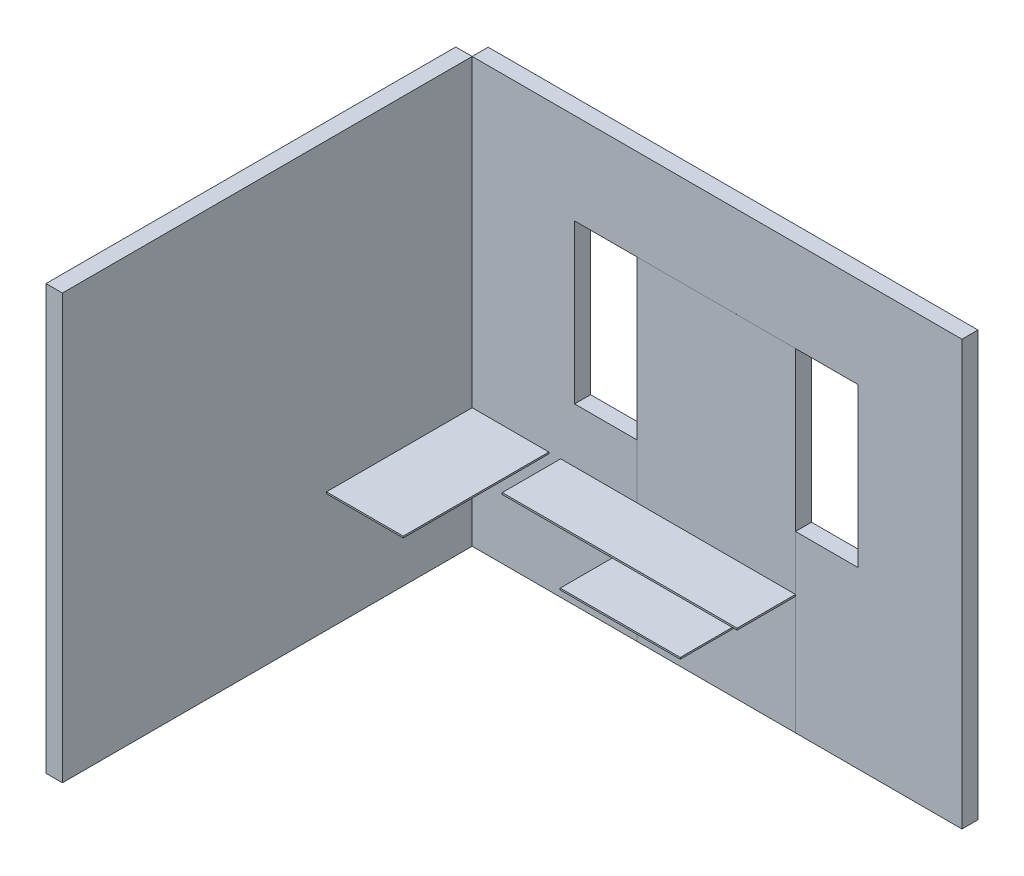
ISO-10303-21;
HEADER;
FILE_DESCRIPTION(('STEP AP214'),'2;1');
FILE_NAME('part.step','',(''),(''),'','','');
FILE_SCHEMA(('AUTOMOTIVE_DESIGN { 1 0 10303 214 1 1 1 1 }'));
ENDSEC;
DATA;
#1=APPLICATION_CONTEXT('core data for automotive mechanical design processes');
#2=APPLICATION_PROTOCOL_DEFINITION('international standard','automotive_design',2000,#1);
#3=PRODUCT_CONTEXT('',#1,'mechanical');
#4=PRODUCT('Part','Part','',(#3));
#5=PRODUCT_RELATED_PRODUCT_CATEGORY('part','',(#4));
#6=PRODUCT_DEFINITION_FORMATION('','',#4);
#7=PRODUCT_DEFINITION_CONTEXT('part definition',#1,'design');
#8=PRODUCT_DEFINITION('design','',#6,#7);
#9=PRODUCT_DEFINITION_SHAPE('','',#8);
#10=(LENGTH_UNIT() NAMED_UNIT(*) SI_UNIT(.MILLI.,.METRE.));
#11=(NAMED_UNIT(*) PLANE_ANGLE_UNIT() SI_UNIT($,.RADIAN.));
#12=(NAMED_UNIT(*) SI_UNIT($,.STERADIAN.) SOLID_ANGLE_UNIT());
#13=UNCERTAINTY_MEASURE_WITH_UNIT(LENGTH_MEASURE(1.E-05),#10,'distance_accuracy_value','');
#14=(GEOMETRIC_REPRESENTATION_CONTEXT(3) GLOBAL_UNCERTAINTY_ASSIGNED_CONTEXT((#13)) GLOBAL_UNIT_ASSIGNED_CONTEXT((#10,
#11,#12)) REPRESENTATION_CONTEXT('',''));
#15=CARTESIAN_POINT('',(0.,0.,0.));
#16=DIRECTION('',(0.,0.,1.));
#17=DIRECTION('',(1.,0.,0.));
#18=AXIS2_PLACEMENT_3D('',#15,#16,#17);
#19=CARTESIAN_POINT('',(0.,749.389851407304,1010.));
#20=DIRECTION('',(1.,0.,0.));
#21=DIRECTION('',(0.,0.,-1.));
#22=AXIS2_PLACEMENT_3D('',#19,#20,#21);
#23=PLANE('',#22);
#24=DIRECTION('',(0.,-1.,0.));
#25=VECTOR('',#24,1.);
#26=CARTESIAN_POINT('',(0.,749.389851407304,100.));
#27=LINE('',#26,#25);
#28=CARTESIAN_POINT('',(0.,749.389851407304,100.));
#29=VERTEX_POINT('',#28);
#30=CARTESIAN_POINT('',(0.,739.389851407304,100.));
#31=VERTEX_POINT('',#30);
#32=EDGE_CURVE('E109',#29,#31,#27,.T.);
#33=ORIENTED_EDGE('',*,*,#32,.T.);
#34=DIRECTION('',(0.,0.,-1.));
#35=VECTOR('',#34,1.);
#36=CARTESIAN_POINT('',(0.,739.389851407304,1010.));
#37=LINE('',#36,#35);
#38=CARTESIAN_POINT('',(0.,739.389851407304,1010.));
#39=VERTEX_POINT('',#38);
#40=EDGE_CURVE('E12',#39,#31,#37,.T.);
#41=ORIENTED_EDGE('',*,*,#40,.F.);
#42=DIRECTION('',(0.,-1.,0.));
#43=VECTOR('',#42,1.);
#44=CARTESIAN_POINT('',(0.,749.389851407304,1010.));
#45=LINE('',#44,#43);
#46=CARTESIAN_POINT('',(0.,749.389851407304,1010.));
#47=VERTEX_POINT('',#46);
#48=EDGE_CURVE('E97',#47,#39,#45,.T.);
#49=ORIENTED_EDGE('',*,*,#48,.F.);
#50=DIRECTION('',(0.,0.,-1.));
#51=VECTOR('',#50,1.);
#52=CARTESIAN_POINT('',(0.,749.389851407304,1010.));
#53=LINE('',#52,#51);
#54=EDGE_CURVE('E105',#47,#29,#53,.T.);
#55=ORIENTED_EDGE('',*,*,#54,.T.);
#56=EDGE_LOOP('',(#33,#41,#49,#55));
#57=FACE_BOUND('',#56,.T.);
#58=ADVANCED_FACE('F46',(#57),#23,.F.);
#59=CARTESIAN_POINT('',(0.,739.389851407304,1010.));
#60=DIRECTION('',(0.,1.,0.));
#61=DIRECTION('',(0.,0.,1.));
#62=AXIS2_PLACEMENT_3D('',#59,#60,#61);
#63=PLANE('',#62);
#64=DIRECTION('',(1.,0.,0.));
#65=VECTOR('',#64,1.);
#66=CARTESIAN_POINT('',(0.,739.389851407304,100.));
#67=LINE('',#66,#65);
#68=CARTESIAN_POINT('',(479.151961804044,739.389851407304,100.));
#69=VERTEX_POINT('',#68);
#70=EDGE_CURVE('E101',#31,#69,#67,.T.);
#71=ORIENTED_EDGE('',*,*,#70,.T.);
#72=DIRECTION('',(0.,0.,-1.));
#73=VECTOR('',#72,1.);
#74=CARTESIAN_POINT('',(479.151961804044,739.389851407304,1010.));
#75=LINE('',#74,#73);
#76=CARTESIAN_POINT('',(479.151961804044,739.389851407304,1010.));
#77=VERTEX_POINT('',#76);
#78=EDGE_CURVE('E54',#77,#69,#75,.T.);
#79=ORIENTED_EDGE('',*,*,#78,.F.);
#80=DIRECTION('',(1.,0.,0.));
#81=VECTOR('',#80,1.);
#82=CARTESIAN_POINT('',(0.,739.389851407304,1010.));
#83=LINE('',#82,#81);
#84=EDGE_CURVE('E92',#39,#77,#83,.T.);
#85=ORIENTED_EDGE('',*,*,#84,.F.);
#86=ORIENTED_EDGE('',*,*,#40,.T.);
#87=EDGE_LOOP('',(#71,#79,#85,#86));
#88=FACE_BOUND('',#87,.T.);
#89=ADVANCED_FACE('F100',(#88),#63,.F.);
#90=CARTESIAN_POINT('',(479.151961804044,739.389851407304,1010.));
#91=DIRECTION('',(-1.,0.,0.));
#92=DIRECTION('',(0.,0.,1.));
#93=AXIS2_PLACEMENT_3D('',#90,#91,#92);
#94=PLANE('',#93);
#95=DIRECTION('',(0.,1.,0.));
#96=VECTOR('',#95,1.);
#97=CARTESIAN_POINT('',(479.151961804044,739.389851407304,100.));
#98=LINE('',#97,#96);
#99=CARTESIAN_POINT('',(479.151961804044,749.389851407304,100.));
#100=VERTEX_POINT('',#99);
#101=EDGE_CURVE('E79',#69,#100,#98,.T.);
#102=ORIENTED_EDGE('',*,*,#101,.T.);
#103=DIRECTION('',(0.,0.,-1.));
#104=VECTOR('',#103,1.);
#105=CARTESIAN_POINT('',(479.151961804044,749.389851407304,1010.));
#106=LINE('',#105,#104);
#107=CARTESIAN_POINT('',(479.151961804044,749.389851407304,1010.));
#108=VERTEX_POINT('',#107);
#109=EDGE_CURVE('E102',#108,#100,#106,.T.);
#110=ORIENTED_EDGE('',*,*,#109,.F.);
#111=DIRECTION('',(0.,1.,0.));
#112=VECTOR('',#111,1.);
#113=CARTESIAN_POINT('',(479.151961804044,739.389851407304,1010.));
#114=LINE('',#113,#112);
#115=EDGE_CURVE('E95',#77,#108,#114,.T.);
#116=ORIENTED_EDGE('',*,*,#115,.F.);
#117=ORIENTED_EDGE('',*,*,#78,.T.);
#118=EDGE_LOOP('',(#102,#110,#116,#117));
#119=FACE_BOUND('',#118,.T.);
#120=ADVANCED_FACE('F103',(#119),#94,.F.);
#121=CARTESIAN_POINT('',(479.151961804044,749.389851407304,1010.));
#122=DIRECTION('',(0.,-1.,0.));
#123=DIRECTION('',(0.,0.,-1.));
#124=AXIS2_PLACEMENT_3D('',#121,#122,#123);
#125=PLANE('',#124);
#126=DIRECTION('',(-1.,0.,0.));
#127=VECTOR('',#126,1.);
#128=CARTESIAN_POINT('',(479.151961804044,749.389851407304,100.));
#129=LINE('',#128,#127);
#130=EDGE_CURVE('E85',#100,#29,#129,.T.);
#131=ORIENTED_EDGE('',*,*,#130,.T.);
#132=ORIENTED_EDGE('',*,*,#54,.F.);
#133=DIRECTION('',(-1.,0.,0.));
#134=VECTOR('',#133,1.);
#135=CARTESIAN_POINT('',(479.151961804044,749.389851407304,1010.));
#136=LINE('',#135,#134);
#137=EDGE_CURVE('E62',#108,#47,#136,.T.);
#138=ORIENTED_EDGE('',*,*,#137,.F.);
#139=ORIENTED_EDGE('',*,*,#109,.T.);
#140=EDGE_LOOP('',(#131,#132,#138,#139));
#141=FACE_BOUND('',#140,.T.);
#142=ADVANCED_FACE('F116',(#141),#125,.F.);
#143=CARTESIAN_POINT('',(0.,0.,1010.));
#144=DIRECTION('',(0.,0.,1.));
#145=DIRECTION('',(1.,0.,0.));
#146=AXIS2_PLACEMENT_3D('',#143,#144,#145);
#147=PLANE('',#146);
#148=ORIENTED_EDGE('',*,*,#48,.T.);
#149=ORIENTED_EDGE('',*,*,#84,.T.);
#150=ORIENTED_EDGE('',*,*,#115,.T.);
#151=ORIENTED_EDGE('',*,*,#137,.T.);
#152=EDGE_LOOP('',(#148,#149,#150,#151));
#153=FACE_BOUND('',#152,.T.);
#154=ADVANCED_FACE('F93',(#153),#147,.T.);
#155=CARTESIAN_POINT('',(0.,0.,100.));
#156=DIRECTION('',(0.,0.,1.));
#157=DIRECTION('',(1.,0.,0.));
#158=AXIS2_PLACEMENT_3D('',#155,#156,#157);
#159=PLANE('',#158);
#160=ORIENTED_EDGE('',*,*,#32,.F.);
#161=ORIENTED_EDGE('',*,*,#130,.F.);
#162=ORIENTED_EDGE('',*,*,#101,.F.);
#163=ORIENTED_EDGE('',*,*,#70,.F.);
#164=EDGE_LOOP('',(#160,#161,#162,#163));
#165=FACE_BOUND('',#164,.T.);
#166=ADVANCED_FACE('F119',(#165),#159,.F.);
#167=CLOSED_SHELL('',(#58,#89,#120,#142,#154,#166));
#168=MANIFOLD_SOLID_BREP('B2',#167);
#169=CARTESIAN_POINT('',(0.,0.,2660.));
#170=DIRECTION('',(-1.,0.,0.));
#171=DIRECTION('',(0.,0.,1.));
#172=AXIS2_PLACEMENT_3D('',#169,#170,#171);
#173=PLANE('',#172);
#174=DIRECTION('',(0.,1.,0.));
#175=VECTOR('',#174,1.);
#176=CARTESIAN_POINT('',(0.,0.,100.));
#177=LINE('',#176,#175);
#178=CARTESIAN_POINT('',(0.,0.,100.));
#179=VERTEX_POINT('',#178);
#180=CARTESIAN_POINT('',(0.,2650.,100.));
#181=VERTEX_POINT('',#180);
#182=EDGE_CURVE('E242',#179,#181,#177,.T.);
#183=ORIENTED_EDGE('',*,*,#182,.T.);
#184=DIRECTION('',(0.,0.,-1.));
#185=VECTOR('',#184,1.);
#186=CARTESIAN_POINT('',(0.,2650.,2660.));
#187=LINE('',#186,#185);
#188=CARTESIAN_POINT('',(0.,2650.,2660.));
#189=VERTEX_POINT('',#188);
#190=EDGE_CURVE('E44',#189,#181,#187,.T.);
#191=ORIENTED_EDGE('',*,*,#190,.F.);
#192=DIRECTION('',(0.,1.,0.));
#193=VECTOR('',#192,1.);
#194=CARTESIAN_POINT('',(0.,0.,2660.));
#195=LINE('',#194,#193);
#196=CARTESIAN_POINT('',(0.,0.,2660.));
#197=VERTEX_POINT('',#196);
#198=EDGE_CURVE('E230',#197,#189,#195,.T.);
#199=ORIENTED_EDGE('',*,*,#198,.F.);
#200=DIRECTION('',(0.,0.,-1.));
#201=VECTOR('',#200,1.);
#202=CARTESIAN_POINT('',(0.,0.,2660.));
#203=LINE('',#202,#201);
#204=EDGE_CURVE('E238',#197,#179,#203,.T.);
#205=ORIENTED_EDGE('',*,*,#204,.T.);
#206=EDGE_LOOP('',(#183,#191,#199,#205));
#207=FACE_BOUND('',#206,.T.);
#208=ADVANCED_FACE('F179',(#207),#173,.F.);
#209=CARTESIAN_POINT('',(0.,2650.,2660.));
#210=DIRECTION('',(0.,-1.,0.));
#211=DIRECTION('',(0.,0.,-1.));
#212=AXIS2_PLACEMENT_3D('',#209,#210,#211);
#213=PLANE('',#212);
#214=DIRECTION('',(-1.,0.,0.));
#215=VECTOR('',#214,1.);
#216=CARTESIAN_POINT('',(0.,2650.,100.));
#217=LINE('',#216,#215);
#218=CARTESIAN_POINT('',(-102.431246956225,2650.,100.));
#219=VERTEX_POINT('',#218);
#220=EDGE_CURVE('E234',#181,#219,#217,.T.);
#221=ORIENTED_EDGE('',*,*,#220,.T.);
#222=DIRECTION('',(0.,0.,-1.));
#223=VECTOR('',#222,1.);
#224=CARTESIAN_POINT('',(-102.431246956225,2650.,2660.));
#225=LINE('',#224,#223);
#226=CARTESIAN_POINT('',(-102.431246956225,2650.,2660.));
#227=VERTEX_POINT('',#226);
#228=EDGE_CURVE('E187',#227,#219,#225,.T.);
#229=ORIENTED_EDGE('',*,*,#228,.F.);
#230=DIRECTION('',(-1.,0.,0.));
#231=VECTOR('',#230,1.);
#232=CARTESIAN_POINT('',(0.,2650.,2660.));
#233=LINE('',#232,#231);
#234=EDGE_CURVE('E225',#189,#227,#233,.T.);
#235=ORIENTED_EDGE('',*,*,#234,.F.);
#236=ORIENTED_EDGE('',*,*,#190,.T.);
#237=EDGE_LOOP('',(#221,#229,#235,#236));
#238=FACE_BOUND('',#237,.T.);
#239=ADVANCED_FACE('F233',(#238),#213,.F.);
#240=CARTESIAN_POINT('',(-102.431246956225,2650.,2660.));
#241=DIRECTION('',(1.,0.,0.));
#242=DIRECTION('',(0.,0.,-1.));
#243=AXIS2_PLACEMENT_3D('',#240,#241,#242);
#244=PLANE('',#243);
#245=DIRECTION('',(0.,-1.,0.));
#246=VECTOR('',#245,1.);
#247=CARTESIAN_POINT('',(-102.431246956225,2650.,100.));
#248=LINE('',#247,#246);
#249=CARTESIAN_POINT('',(-102.431246956225,0.,100.));
#250=VERTEX_POINT('',#249);
#251=EDGE_CURVE('E212',#219,#250,#248,.T.);
#252=ORIENTED_EDGE('',*,*,#251,.T.);
#253=DIRECTION('',(0.,0.,-1.));
#254=VECTOR('',#253,1.);
#255=CARTESIAN_POINT('',(-102.431246956225,0.,2660.));
#256=LINE('',#255,#254);
#257=CARTESIAN_POINT('',(-102.431246956225,0.,2660.));
#258=VERTEX_POINT('',#257);
#259=EDGE_CURVE('E235',#258,#250,#256,.T.);
#260=ORIENTED_EDGE('',*,*,#259,.F.);
#261=DIRECTION('',(0.,-1.,0.));
#262=VECTOR('',#261,1.);
#263=CARTESIAN_POINT('',(-102.431246956225,2650.,2660.));
#264=LINE('',#263,#262);
#265=EDGE_CURVE('E228',#227,#258,#264,.T.);
#266=ORIENTED_EDGE('',*,*,#265,.F.);
#267=ORIENTED_EDGE('',*,*,#228,.T.);
#268=EDGE_LOOP('',(#252,#260,#266,#267));
#269=FACE_BOUND('',#268,.T.);
#270=ADVANCED_FACE('F236',(#269),#244,.F.);
#271=CARTESIAN_POINT('',(-102.431246956225,0.,2660.));
#272=DIRECTION('',(0.,1.,0.));
#273=DIRECTION('',(0.,0.,1.));
#274=AXIS2_PLACEMENT_3D('',#271,#272,#273);
#275=PLANE('',#274);
#276=DIRECTION('',(1.,0.,0.));
#277=VECTOR('',#276,1.);
#278=CARTESIAN_POINT('',(-102.431246956225,0.,100.));
#279=LINE('',#278,#277);
#280=EDGE_CURVE('E218',#250,#179,#279,.T.);
#281=ORIENTED_EDGE('',*,*,#280,.T.);
#282=ORIENTED_EDGE('',*,*,#204,.F.);
#283=DIRECTION('',(1.,0.,0.));
#284=VECTOR('',#283,1.);
#285=CARTESIAN_POINT('',(-102.431246956225,0.,2660.));
#286=LINE('',#285,#284);
#287=EDGE_CURVE('E195',#258,#197,#286,.T.);
#288=ORIENTED_EDGE('',*,*,#287,.F.);
#289=ORIENTED_EDGE('',*,*,#259,.T.);
#290=EDGE_LOOP('',(#281,#282,#288,#289));
#291=FACE_BOUND('',#290,.T.);
#292=ADVANCED_FACE('F249',(#291),#275,.F.);
#293=CARTESIAN_POINT('',(0.,0.,2660.));
#294=DIRECTION('',(0.,0.,1.));
#295=DIRECTION('',(1.,0.,0.));
#296=AXIS2_PLACEMENT_3D('',#293,#294,#295);
#297=PLANE('',#296);
#298=ORIENTED_EDGE('',*,*,#198,.T.);
#299=ORIENTED_EDGE('',*,*,#234,.T.);
#300=ORIENTED_EDGE('',*,*,#265,.T.);
#301=ORIENTED_EDGE('',*,*,#287,.T.);
#302=EDGE_LOOP('',(#298,#299,#300,#301));
#303=FACE_BOUND('',#302,.T.);
#304=ADVANCED_FACE('F226',(#303),#297,.T.);
#305=CARTESIAN_POINT('',(0.,0.,100.));
#306=DIRECTION('',(0.,0.,1.));
#307=DIRECTION('',(1.,0.,0.));
#308=AXIS2_PLACEMENT_3D('',#305,#306,#307);
#309=PLANE('',#308);
#310=ORIENTED_EDGE('',*,*,#182,.F.);
#311=ORIENTED_EDGE('',*,*,#280,.F.);
#312=ORIENTED_EDGE('',*,*,#251,.F.);
#313=ORIENTED_EDGE('',*,*,#220,.F.);
#314=EDGE_LOOP('',(#310,#311,#312,#313));
#315=FACE_BOUND('',#314,.T.);
#316=ADVANCED_FACE('F252',(#315),#309,.F.);
#317=CLOSED_SHELL('',(#208,#239,#270,#292,#304,#316));
#318=MANIFOLD_SOLID_BREP('B6',#317);
#319=CARTESIAN_POINT('',(0.,0.,100.01));
#320=DIRECTION('',(0.,0.,-1.));
#321=DIRECTION('',(-1.,0.,0.));
#322=AXIS2_PLACEMENT_3D('',#319,#320,#321);
#323=PLANE('',#322);
#324=DIRECTION('',(-0.999999991053058,0.000133768021911624,0.));
#325=VECTOR('',#324,1.);
#326=CARTESIAN_POINT('',(1030.,738.679910911235,100.01));
#327=LINE('',#326,#325);
#328=CARTESIAN_POINT('',(2020.,738.547480568357,100.01));
#329=VERTEX_POINT('',#328);
#330=CARTESIAN_POINT('',(1030.,738.679910911235,100.01));
#331=VERTEX_POINT('',#330);
#332=EDGE_CURVE('E505',#329,#331,#327,.T.);
#333=ORIENTED_EDGE('',*,*,#332,.T.);
#334=DIRECTION('',(0.,-1.,0.));
#335=VECTOR('',#334,1.);
#336=CARTESIAN_POINT('',(1030.,0.,100.01));
#337=LINE('',#336,#335);
#338=CARTESIAN_POINT('',(1030.,0.,100.01));
#339=VERTEX_POINT('',#338);
#340=EDGE_CURVE('E513',#331,#339,#337,.T.);
#341=ORIENTED_EDGE('',*,*,#340,.T.);
#342=DIRECTION('',(1.,0.,0.));
#343=VECTOR('',#342,1.);
#344=CARTESIAN_POINT('',(2020.,0.,100.01));
#345=LINE('',#344,#343);
#346=CARTESIAN_POINT('',(2020.,0.,100.01));
#347=VERTEX_POINT('',#346);
#348=EDGE_CURVE('E515',#339,#347,#345,.T.);
#349=ORIENTED_EDGE('',*,*,#348,.T.);
#350=DIRECTION('',(0.,1.,0.));
#351=VECTOR('',#350,1.);
#352=CARTESIAN_POINT('',(2020.,738.547480568357,100.01));
#353=LINE('',#352,#351);
#354=EDGE_CURVE('E517',#347,#329,#353,.T.);
#355=ORIENTED_EDGE('',*,*,#354,.T.);
#356=EDGE_LOOP('',(#333,#341,#349,#355));
#357=FACE_BOUND('',#356,.T.);
#358=DIRECTION('',(0.,1.,0.));
#359=VECTOR('',#358,1.);
#360=CARTESIAN_POINT('',(1900.,648.613695739796,100.01));
#361=LINE('',#360,#359);
#362=CARTESIAN_POINT('',(1900.,638.613695739796,100.01));
#363=VERTEX_POINT('',#362);
#364=CARTESIAN_POINT('',(1900.,648.613695739796,100.01));
#365=VERTEX_POINT('',#364);
#366=EDGE_CURVE('E501',#363,#365,#361,.T.);
#367=ORIENTED_EDGE('',*,*,#366,.F.);
#368=DIRECTION('',(1.,0.,0.));
#369=VECTOR('',#368,1.);
#370=CARTESIAN_POINT('',(1900.,638.613695739796,100.01));
#371=LINE('',#370,#369);
#372=CARTESIAN_POINT('',(1150.,638.613695739796,100.01));
#373=VERTEX_POINT('',#372);
#374=EDGE_CURVE('E498',#373,#363,#371,.T.);
#375=ORIENTED_EDGE('',*,*,#374,.F.);
#376=DIRECTION('',(0.,-1.,0.));
#377=VECTOR('',#376,1.);
#378=CARTESIAN_POINT('',(1150.,638.613695739796,100.01));
#379=LINE('',#378,#377);
#380=CARTESIAN_POINT('',(1150.,648.613695739796,100.01));
#381=VERTEX_POINT('',#380);
#382=EDGE_CURVE('E335',#381,#373,#379,.T.);
#383=ORIENTED_EDGE('',*,*,#382,.F.);
#384=DIRECTION('',(-1.,0.,0.));
#385=VECTOR('',#384,1.);
#386=CARTESIAN_POINT('',(1150.,648.613695739796,100.01));
#387=LINE('',#386,#385);
#388=EDGE_CURVE('E330',#365,#381,#387,.T.);
#389=ORIENTED_EDGE('',*,*,#388,.F.);
#390=EDGE_LOOP('',(#367,#375,#383,#389));
#391=FACE_BOUND('',#390,.T.);
#392=ADVANCED_FACE('F315',(#357,#391),#323,.F.);
#393=CARTESIAN_POINT('',(0.,0.,100.));
#394=DIRECTION('',(0.,0.,-1.));
#395=DIRECTION('',(-1.,0.,0.));
#396=AXIS2_PLACEMENT_3D('',#393,#394,#395);
#397=PLANE('',#396);
#398=DIRECTION('',(0.,-1.,0.));
#399=VECTOR('',#398,1.);
#400=CARTESIAN_POINT('',(1030.,0.,100.));
#401=LINE('',#400,#399);
#402=CARTESIAN_POINT('',(1030.,738.679910911235,100.));
#403=VERTEX_POINT('',#402);
#404=CARTESIAN_POINT('',(1030.,0.,100.));
#405=VERTEX_POINT('',#404);
#406=EDGE_CURVE('E502',#403,#405,#401,.T.);
#407=ORIENTED_EDGE('',*,*,#406,.F.);
#408=DIRECTION('',(0.999999991053058,-0.000133768021911656,0.));
#409=VECTOR('',#408,1.);
#410=CARTESIAN_POINT('',(2020.,738.547480568357,100.));
#411=LINE('',#410,#409);
#412=CARTESIAN_POINT('',(552.86688513099,738.74373606477,100.));
#413=VERTEX_POINT('',#412);
#414=EDGE_CURVE('E564',#413,#403,#411,.T.);
#415=ORIENTED_EDGE('',*,*,#414,.F.);
#416=DIRECTION('',(0.,-1.,0.));
#417=VECTOR('',#416,1.);
#418=CARTESIAN_POINT('',(552.86688513099,738.74373606477,100.));
#419=LINE('',#418,#417);
#420=CARTESIAN_POINT('',(552.86688513099,749.389851407304,100.));
#421=VERTEX_POINT('',#420);
#422=EDGE_CURVE('E550',#421,#413,#419,.T.);
#423=ORIENTED_EDGE('',*,*,#422,.F.);
#424=DIRECTION('',(-1.,0.,0.));
#425=VECTOR('',#424,1.);
#426=CARTESIAN_POINT('',(552.86688513099,749.389851407304,100.));
#427=LINE('',#426,#425);
#428=CARTESIAN_POINT('',(1030.,749.389851407304,100.));
#429=VERTEX_POINT('',#428);
#430=EDGE_CURVE('E555',#429,#421,#427,.T.);
#431=ORIENTED_EDGE('',*,*,#430,.F.);
#432=DIRECTION('',(0.,-1.,0.));
#433=VECTOR('',#432,1.);
#434=CARTESIAN_POINT('',(1030.,2080.,100.));
#435=LINE('',#434,#433);
#436=CARTESIAN_POINT('',(1030.,1090.,100.));
#437=VERTEX_POINT('',#436);
#438=EDGE_CURVE('E529',#437,#429,#435,.T.);
#439=ORIENTED_EDGE('',*,*,#438,.F.);
#440=DIRECTION('',(1.,0.,0.));
#441=VECTOR('',#440,1.);
#442=CARTESIAN_POINT('',(1030.,1090.,100.));
#443=LINE('',#442,#441);
#444=CARTESIAN_POINT('',(640.,1090.,100.));
#445=VERTEX_POINT('',#444);
#446=EDGE_CURVE('E586',#445,#437,#443,.T.);
#447=ORIENTED_EDGE('',*,*,#446,.F.);
#448=DIRECTION('',(0.,-1.,0.));
#449=VECTOR('',#448,1.);
#450=CARTESIAN_POINT('',(640.,2080.,100.));
#451=LINE('',#450,#449);
#452=CARTESIAN_POINT('',(640.,2080.,100.));
#453=VERTEX_POINT('',#452);
#454=EDGE_CURVE('E583',#453,#445,#451,.T.);
#455=ORIENTED_EDGE('',*,*,#454,.F.);
#456=DIRECTION('',(-1.,0.,0.));
#457=VECTOR('',#456,1.);
#458=CARTESIAN_POINT('',(640.,2080.,100.));
#459=LINE('',#458,#457);
#460=CARTESIAN_POINT('',(1030.,2080.,100.));
#461=VERTEX_POINT('',#460);
#462=EDGE_CURVE('E581',#461,#453,#459,.T.);
#463=ORIENTED_EDGE('',*,*,#462,.F.);
#464=DIRECTION('',(-1.,0.,0.));
#465=VECTOR('',#464,1.);
#466=CARTESIAN_POINT('',(1030.,2080.,100.));
#467=LINE('',#466,#465);
#468=CARTESIAN_POINT('',(2020.,2080.,100.));
#469=VERTEX_POINT('',#468);
#470=EDGE_CURVE('E534',#469,#461,#467,.T.);
#471=ORIENTED_EDGE('',*,*,#470,.F.);
#472=DIRECTION('',(-1.,0.,0.));
#473=VECTOR('',#472,1.);
#474=CARTESIAN_POINT('',(2410.,2080.,100.));
#475=LINE('',#474,#473);
#476=CARTESIAN_POINT('',(2410.,2080.,100.));
#477=VERTEX_POINT('',#476);
#478=EDGE_CURVE('E605',#477,#469,#475,.T.);
#479=ORIENTED_EDGE('',*,*,#478,.F.);
#480=DIRECTION('',(0.,1.,0.));
#481=VECTOR('',#480,1.);
#482=CARTESIAN_POINT('',(2410.,1090.,100.));
#483=LINE('',#482,#481);
#484=CARTESIAN_POINT('',(2410.,1090.,100.));
#485=VERTEX_POINT('',#484);
#486=EDGE_CURVE('E602',#485,#477,#483,.T.);
#487=ORIENTED_EDGE('',*,*,#486,.F.);
#488=DIRECTION('',(1.,0.,0.));
#489=VECTOR('',#488,1.);
#490=CARTESIAN_POINT('',(2020.,1090.,100.));
#491=LINE('',#490,#489);
#492=CARTESIAN_POINT('',(2020.,1090.,100.));
#493=VERTEX_POINT('',#492);
#494=EDGE_CURVE('E593',#493,#485,#491,.T.);
#495=ORIENTED_EDGE('',*,*,#494,.F.);
#496=DIRECTION('',(0.,1.,0.));
#497=VECTOR('',#496,1.);
#498=CARTESIAN_POINT('',(2020.,749.389851407304,100.));
#499=LINE('',#498,#497);
#500=CARTESIAN_POINT('',(2020.,0.,100.));
#501=VERTEX_POINT('',#500);
#502=EDGE_CURVE('E567',#501,#493,#499,.T.);
#503=ORIENTED_EDGE('',*,*,#502,.F.);
#504=DIRECTION('',(1.,0.,0.));
#505=VECTOR('',#504,1.);
#506=CARTESIAN_POINT('',(0.,0.,100.));
#507=LINE('',#506,#505);
#508=CARTESIAN_POINT('',(3060.,0.,100.));
#509=VERTEX_POINT('',#508);
#510=EDGE_CURVE('E623',#501,#509,#507,.T.);
#511=ORIENTED_EDGE('',*,*,#510,.T.);
#512=DIRECTION('',(0.,1.,0.));
#513=VECTOR('',#512,1.);
#514=CARTESIAN_POINT('',(3060.,0.,100.));
#515=LINE('',#514,#513);
#516=CARTESIAN_POINT('',(3060.,2650.,100.));
#517=VERTEX_POINT('',#516);
#518=EDGE_CURVE('E627',#509,#517,#515,.T.);
#519=ORIENTED_EDGE('',*,*,#518,.T.);
#520=DIRECTION('',(-1.,0.,0.));
#521=VECTOR('',#520,1.);
#522=CARTESIAN_POINT('',(0.,2650.,100.));
#523=LINE('',#522,#521);
#524=CARTESIAN_POINT('',(0.,2650.,100.));
#525=VERTEX_POINT('',#524);
#526=EDGE_CURVE('E629',#517,#525,#523,.T.);
#527=ORIENTED_EDGE('',*,*,#526,.T.);
#528=DIRECTION('',(0.,-1.,0.));
#529=VECTOR('',#528,1.);
#530=CARTESIAN_POINT('',(0.,0.,100.));
#531=LINE('',#530,#529);
#532=CARTESIAN_POINT('',(0.,0.,100.));
#533=VERTEX_POINT('',#532);
#534=EDGE_CURVE('E620',#525,#533,#531,.T.);
#535=ORIENTED_EDGE('',*,*,#534,.T.);
#536=EDGE_CURVE('E625',#533,#405,#507,.T.);
#537=ORIENTED_EDGE('',*,*,#536,.T.);
#538=EDGE_LOOP('',(#407,#415,#423,#431,#439,#447,#455,#463,#471,#479,#487,#495,#503,#511,#519,
#527,#535,#537));
#539=FACE_BOUND('',#538,.T.);
#540=ADVANCED_FACE('F686',(#539),#397,.F.);
#541=CARTESIAN_POINT('',(2020.,738.547480568357,465.));
#542=DIRECTION('',(0.000133768021911656,0.999999991053058,0.));
#543=DIRECTION('',(-0.999999991053058,0.000133768021911656,0.));
#544=AXIS2_PLACEMENT_3D('',#541,#542,#543);
#545=PLANE('',#544);
#546=DIRECTION('',(0.,0.,-1.));
#547=VECTOR('',#546,1.);
#548=CARTESIAN_POINT('',(1030.,738.679910911235,100.01));
#549=LINE('',#548,#547);
#550=EDGE_CURVE('E526',#331,#403,#549,.T.);
#551=ORIENTED_EDGE('',*,*,#550,.F.);
#552=ORIENTED_EDGE('',*,*,#332,.F.);
#553=DIRECTION('',(0.,0.,-1.));
#554=VECTOR('',#553,1.);
#555=CARTESIAN_POINT('',(2020.,738.547480568357,465.));
#556=LINE('',#555,#554);
#557=CARTESIAN_POINT('',(2020.,738.547480568357,465.));
#558=VERTEX_POINT('',#557);
#559=EDGE_CURVE('E575',#558,#329,#556,.T.);
#560=ORIENTED_EDGE('',*,*,#559,.F.);
#561=DIRECTION('',(0.999999991053058,-0.000133768021911656,0.));
#562=VECTOR('',#561,1.);
#563=CARTESIAN_POINT('',(2020.,738.547480568357,465.));
#564=LINE('',#563,#562);
#565=CARTESIAN_POINT('',(552.86688513099,738.74373606477,465.));
#566=VERTEX_POINT('',#565);
#567=EDGE_CURVE('E554',#566,#558,#564,.T.);
#568=ORIENTED_EDGE('',*,*,#567,.F.);
#569=DIRECTION('',(0.,0.,-1.));
#570=VECTOR('',#569,1.);
#571=CARTESIAN_POINT('',(552.86688513099,738.74373606477,465.));
#572=LINE('',#571,#570);
#573=EDGE_CURVE('E578',#566,#413,#572,.T.);
#574=ORIENTED_EDGE('',*,*,#573,.T.);
#575=ORIENTED_EDGE('',*,*,#414,.T.);
#576=EDGE_LOOP('',(#551,#552,#560,#568,#574,#575));
#577=FACE_BOUND('',#576,.T.);
#578=ADVANCED_FACE('F727',(#577),#545,.F.);
#579=CARTESIAN_POINT('',(552.86688513099,749.389851407304,465.));
#580=DIRECTION('',(0.,-1.,0.));
#581=DIRECTION('',(0.,0.,-1.));
#582=AXIS2_PLACEMENT_3D('',#579,#580,#581);
#583=PLANE('',#582);
#584=DIRECTION('',(0.,0.,-1.));
#585=VECTOR('',#584,1.);
#586=CARTESIAN_POINT('',(1030.,749.389851407304,100.01));
#587=LINE('',#586,#585);
#588=CARTESIAN_POINT('',(1030.,749.389851407304,100.01));
#589=VERTEX_POINT('',#588);
#590=EDGE_CURVE('E547',#589,#429,#587,.T.);
#591=ORIENTED_EDGE('',*,*,#590,.T.);
#592=ORIENTED_EDGE('',*,*,#430,.T.);
#593=DIRECTION('',(0.,0.,-1.));
#594=VECTOR('',#593,1.);
#595=CARTESIAN_POINT('',(552.86688513099,749.389851407304,465.));
#596=LINE('',#595,#594);
#597=CARTESIAN_POINT('',(552.86688513099,749.389851407304,465.));
#598=VERTEX_POINT('',#597);
#599=EDGE_CURVE('E561',#598,#421,#596,.T.);
#600=ORIENTED_EDGE('',*,*,#599,.F.);
#601=DIRECTION('',(-1.,0.,0.));
#602=VECTOR('',#601,1.);
#603=CARTESIAN_POINT('',(552.86688513099,749.389851407304,465.));
#604=LINE('',#603,#602);
#605=CARTESIAN_POINT('',(2020.,749.389851407304,465.));
#606=VERTEX_POINT('',#605);
#607=EDGE_CURVE('E559',#606,#598,#604,.T.);
#608=ORIENTED_EDGE('',*,*,#607,.F.);
#609=DIRECTION('',(0.,0.,-1.));
#610=VECTOR('',#609,1.);
#611=CARTESIAN_POINT('',(2020.,749.389851407304,465.));
#612=LINE('',#611,#610);
#613=CARTESIAN_POINT('',(2020.,749.389851407304,100.01));
#614=VERTEX_POINT('',#613);
#615=EDGE_CURVE('E572',#606,#614,#612,.T.);
#616=ORIENTED_EDGE('',*,*,#615,.T.);
#617=DIRECTION('',(1.,0.,0.));
#618=VECTOR('',#617,1.);
#619=CARTESIAN_POINT('',(1030.,749.389851407304,100.01));
#620=LINE('',#619,#618);
#621=EDGE_CURVE('E533',#589,#614,#620,.T.);
#622=ORIENTED_EDGE('',*,*,#621,.F.);
#623=EDGE_LOOP('',(#591,#592,#600,#608,#616,#622));
#624=FACE_BOUND('',#623,.T.);
#625=ADVANCED_FACE('F693',(#624),#583,.F.);
#626=CARTESIAN_POINT('',(0.,0.,100.));
#627=DIRECTION('',(1.,0.,0.));
#628=DIRECTION('',(0.,0.,-1.));
#629=AXIS2_PLACEMENT_3D('',#626,#627,#628);
#630=PLANE('',#629);
#631=DIRECTION('',(0.,-1.,0.));
#632=VECTOR('',#631,1.);
#633=CARTESIAN_POINT('',(0.,0.,0.));
#634=LINE('',#633,#632);
#635=CARTESIAN_POINT('',(0.,2650.,0.));
#636=VERTEX_POINT('',#635);
#637=CARTESIAN_POINT('',(0.,0.,0.));
#638=VERTEX_POINT('',#637);
#639=EDGE_CURVE('E612',#636,#638,#634,.T.);
#640=ORIENTED_EDGE('',*,*,#639,.T.);
#641=DIRECTION('',(0.,0.,-1.));
#642=VECTOR('',#641,1.);
#643=CARTESIAN_POINT('',(0.,0.,100.));
#644=LINE('',#643,#642);
#645=EDGE_CURVE('E647',#533,#638,#644,.T.);
#646=ORIENTED_EDGE('',*,*,#645,.F.);
#647=ORIENTED_EDGE('',*,*,#534,.F.);
#648=DIRECTION('',(0.,0.,-1.));
#649=VECTOR('',#648,1.);
#650=CARTESIAN_POINT('',(0.,2650.,100.));
#651=LINE('',#650,#649);
#652=EDGE_CURVE('E631',#525,#636,#651,.T.);
#653=ORIENTED_EDGE('',*,*,#652,.T.);
#654=EDGE_LOOP('',(#640,#646,#647,#653));
#655=FACE_BOUND('',#654,.T.);
#656=ADVANCED_FACE('F317',(#655),#630,.F.);
#657=CARTESIAN_POINT('',(0.,0.,100.));
#658=DIRECTION('',(0.,1.,0.));
#659=DIRECTION('',(0.,0.,1.));
#660=AXIS2_PLACEMENT_3D('',#657,#658,#659);
#661=PLANE('',#660);
#662=DIRECTION('',(1.,0.,0.));
#663=VECTOR('',#662,1.);
#664=CARTESIAN_POINT('',(0.,0.,0.));
#665=LINE('',#664,#663);
#666=CARTESIAN_POINT('',(3060.,0.,0.));
#667=VERTEX_POINT('',#666);
#668=EDGE_CURVE('E634',#638,#667,#665,.T.);
#669=ORIENTED_EDGE('',*,*,#668,.T.);
#670=DIRECTION('',(0.,0.,-1.));
#671=VECTOR('',#670,1.);
#672=CARTESIAN_POINT('',(3060.,0.,100.));
#673=LINE('',#672,#671);
#674=EDGE_CURVE('E644',#509,#667,#673,.T.);
#675=ORIENTED_EDGE('',*,*,#674,.F.);
#676=ORIENTED_EDGE('',*,*,#510,.F.);
#677=DIRECTION('',(0.,0.,-1.));
#678=VECTOR('',#677,1.);
#679=CARTESIAN_POINT('',(2020.,0.,100.01));
#680=LINE('',#679,#678);
#681=EDGE_CURVE('E519',#347,#501,#680,.T.);
#682=ORIENTED_EDGE('',*,*,#681,.F.);
#683=ORIENTED_EDGE('',*,*,#348,.F.);
#684=DIRECTION('',(0.,0.,-1.));
#685=VECTOR('',#684,1.);
#686=CARTESIAN_POINT('',(1030.,0.,100.01));
#687=LINE('',#686,#685);
#688=EDGE_CURVE('E523',#339,#405,#687,.T.);
#689=ORIENTED_EDGE('',*,*,#688,.T.);
#690=ORIENTED_EDGE('',*,*,#536,.F.);
#691=ORIENTED_EDGE('',*,*,#645,.T.);
#692=EDGE_LOOP('',(#669,#675,#676,#682,#683,#689,#690,#691));
#693=FACE_BOUND('',#692,.T.);
#694=ADVANCED_FACE('F741',(#693),#661,.F.);
#695=CARTESIAN_POINT('',(3060.,0.,100.));
#696=DIRECTION('',(-1.,0.,0.));
#697=DIRECTION('',(0.,0.,1.));
#698=AXIS2_PLACEMENT_3D('',#695,#696,#697);
#699=PLANE('',#698);
#700=DIRECTION('',(0.,1.,0.));
#701=VECTOR('',#700,1.);
#702=CARTESIAN_POINT('',(3060.,0.,0.));
#703=LINE('',#702,#701);
#704=CARTESIAN_POINT('',(3060.,2650.,0.));
#705=VERTEX_POINT('',#704);
#706=EDGE_CURVE('E636',#667,#705,#703,.T.);
#707=ORIENTED_EDGE('',*,*,#706,.T.);
#708=DIRECTION('',(0.,0.,-1.));
#709=VECTOR('',#708,1.);
#710=CARTESIAN_POINT('',(3060.,2650.,100.));
#711=LINE('',#710,#709);
#712=EDGE_CURVE('E641',#517,#705,#711,.T.);
#713=ORIENTED_EDGE('',*,*,#712,.F.);
#714=ORIENTED_EDGE('',*,*,#518,.F.);
#715=ORIENTED_EDGE('',*,*,#674,.T.);
#716=EDGE_LOOP('',(#707,#713,#714,#715));
#717=FACE_BOUND('',#716,.T.);
#718=ADVANCED_FACE('F784',(#717),#699,.F.);
#719=CARTESIAN_POINT('',(0.,2650.,100.));
#720=DIRECTION('',(0.,-1.,0.));
#721=DIRECTION('',(0.,0.,-1.));
#722=AXIS2_PLACEMENT_3D('',#719,#720,#721);
#723=PLANE('',#722);
#724=DIRECTION('',(-1.,0.,0.));
#725=VECTOR('',#724,1.);
#726=CARTESIAN_POINT('',(0.,2650.,0.));
#727=LINE('',#726,#725);
#728=EDGE_CURVE('E624',#705,#636,#727,.T.);
#729=ORIENTED_EDGE('',*,*,#728,.T.);
#730=ORIENTED_EDGE('',*,*,#652,.F.);
#731=ORIENTED_EDGE('',*,*,#526,.F.);
#732=ORIENTED_EDGE('',*,*,#712,.T.);
#733=EDGE_LOOP('',(#729,#730,#731,#732));
#734=FACE_BOUND('',#733,.T.);
#735=ADVANCED_FACE('F781',(#734),#723,.F.);
#736=CARTESIAN_POINT('',(0.,0.,0.));
#737=DIRECTION('',(0.,0.,-1.));
#738=DIRECTION('',(-1.,0.,0.));
#739=AXIS2_PLACEMENT_3D('',#736,#737,#738);
#740=PLANE('',#739);
#741=DIRECTION('',(1.,0.,0.));
#742=VECTOR('',#741,1.);
#743=CARTESIAN_POINT('',(0.,2080.,0.));
#744=LINE('',#743,#742);
#745=CARTESIAN_POINT('',(640.,2080.,0.));
#746=VERTEX_POINT('',#745);
#747=CARTESIAN_POINT('',(1030.,2080.,0.));
#748=VERTEX_POINT('',#747);
#749=EDGE_CURVE('E177',#746,#748,#744,.T.);
#750=ORIENTED_EDGE('',*,*,#749,.F.);
#751=DIRECTION('',(0.,1.,0.));
#752=VECTOR('',#751,1.);
#753=CARTESIAN_POINT('',(640.,0.,0.));
#754=LINE('',#753,#752);
#755=CARTESIAN_POINT('',(640.,1090.,0.));
#756=VERTEX_POINT('',#755);
#757=EDGE_CURVE('E659',#756,#746,#754,.T.);
#758=ORIENTED_EDGE('',*,*,#757,.F.);
#759=DIRECTION('',(-1.,0.,0.));
#760=VECTOR('',#759,1.);
#761=CARTESIAN_POINT('',(0.,1090.,0.));
#762=LINE('',#761,#760);
#763=CARTESIAN_POINT('',(1030.,1090.,0.));
#764=VERTEX_POINT('',#763);
#765=EDGE_CURVE('E661',#764,#756,#762,.T.);
#766=ORIENTED_EDGE('',*,*,#765,.F.);
#767=DIRECTION('',(0.,-1.,0.));
#768=VECTOR('',#767,1.);
#769=CARTESIAN_POINT('',(1030.,0.,0.));
#770=LINE('',#769,#768);
#771=EDGE_CURVE('E323',#748,#764,#770,.T.);
#772=ORIENTED_EDGE('',*,*,#771,.F.);
#773=EDGE_LOOP('',(#750,#758,#766,#772));
#774=FACE_BOUND('',#773,.T.);
#775=DIRECTION('',(-1.,0.,0.));
#776=VECTOR('',#775,1.);
#777=CARTESIAN_POINT('',(0.,1090.,0.));
#778=LINE('',#777,#776);
#779=CARTESIAN_POINT('',(2410.,1090.,0.));
#780=VERTEX_POINT('',#779);
#781=CARTESIAN_POINT('',(2020.,1090.,0.));
#782=VERTEX_POINT('',#781);
#783=EDGE_CURVE('E657',#780,#782,#778,.T.);
#784=ORIENTED_EDGE('',*,*,#783,.F.);
#785=DIRECTION('',(0.,-1.,0.));
#786=VECTOR('',#785,1.);
#787=CARTESIAN_POINT('',(2410.,0.,0.));
#788=LINE('',#787,#786);
#789=CARTESIAN_POINT('',(2410.,2080.,0.));
#790=VERTEX_POINT('',#789);
#791=EDGE_CURVE('E650',#790,#780,#788,.T.);
#792=ORIENTED_EDGE('',*,*,#791,.F.);
#793=DIRECTION('',(1.,0.,0.));
#794=VECTOR('',#793,1.);
#795=CARTESIAN_POINT('',(0.,2080.,0.));
#796=LINE('',#795,#794);
#797=CARTESIAN_POINT('',(2020.,2080.,0.));
#798=VERTEX_POINT('',#797);
#799=EDGE_CURVE('E652',#798,#790,#796,.T.);
#800=ORIENTED_EDGE('',*,*,#799,.F.);
#801=DIRECTION('',(0.,1.,0.));
#802=VECTOR('',#801,1.);
#803=CARTESIAN_POINT('',(2020.,0.,0.));
#804=LINE('',#803,#802);
#805=EDGE_CURVE('E655',#782,#798,#804,.T.);
#806=ORIENTED_EDGE('',*,*,#805,.F.);
#807=EDGE_LOOP('',(#784,#792,#800,#806));
#808=FACE_BOUND('',#807,.T.);
#809=ORIENTED_EDGE('',*,*,#639,.F.);
#810=ORIENTED_EDGE('',*,*,#728,.F.);
#811=ORIENTED_EDGE('',*,*,#706,.F.);
#812=ORIENTED_EDGE('',*,*,#668,.F.);
#813=EDGE_LOOP('',(#809,#810,#811,#812));
#814=FACE_BOUND('',#813,.T.);
#815=ADVANCED_FACE('F675',(#774,#808,#814),#740,.T.);
#816=CARTESIAN_POINT('',(2020.,1090.,-649.));
#817=DIRECTION('',(0.,-1.,0.));
#818=DIRECTION('',(0.,0.,-1.));
#819=AXIS2_PLACEMENT_3D('',#816,#817,#818);
#820=PLANE('',#819);
#821=ORIENTED_EDGE('',*,*,#783,.T.);
#822=DIRECTION('',(0.,0.,1.));
#823=VECTOR('',#822,1.);
#824=CARTESIAN_POINT('',(2020.,1090.,-649.));
#825=LINE('',#824,#823);
#826=EDGE_CURVE('E609',#782,#493,#825,.T.);
#827=ORIENTED_EDGE('',*,*,#826,.T.);
#828=ORIENTED_EDGE('',*,*,#494,.T.);
#829=DIRECTION('',(0.,0.,1.));
#830=VECTOR('',#829,1.);
#831=CARTESIAN_POINT('',(2410.,1090.,-649.));
#832=LINE('',#831,#830);
#833=EDGE_CURVE('E608',#780,#485,#832,.T.);
#834=ORIENTED_EDGE('',*,*,#833,.F.);
#835=EDGE_LOOP('',(#821,#827,#828,#834));
#836=FACE_BOUND('',#835,.T.);
#837=ADVANCED_FACE('F769',(#836),#820,.F.);
#838=CARTESIAN_POINT('',(2020.,2080.,-649.));
#839=DIRECTION('',(-1.,0.,0.));
#840=DIRECTION('',(0.,0.,1.));
#841=AXIS2_PLACEMENT_3D('',#838,#839,#840);
#842=PLANE('',#841);
#843=ORIENTED_EDGE('',*,*,#805,.T.);
#844=DIRECTION('',(0.,0.,1.));
#845=VECTOR('',#844,1.);
#846=CARTESIAN_POINT('',(2020.,2080.,-649.));
#847=LINE('',#846,#845);
#848=EDGE_CURVE('E613',#798,#469,#847,.T.);
#849=ORIENTED_EDGE('',*,*,#848,.T.);
#850=DIRECTION('',(0.,0.,-1.));
#851=VECTOR('',#850,1.);
#852=CARTESIAN_POINT('',(2020.,2080.,100.01));
#853=LINE('',#852,#851);
#854=CARTESIAN_POINT('',(2020.,2080.,100.01));
#855=VERTEX_POINT('',#854);
#856=EDGE_CURVE('E545',#855,#469,#853,.T.);
#857=ORIENTED_EDGE('',*,*,#856,.F.);
#858=DIRECTION('',(0.,1.,0.));
#859=VECTOR('',#858,1.);
#860=CARTESIAN_POINT('',(2020.,2080.,100.01));
#861=LINE('',#860,#859);
#862=EDGE_CURVE('E536',#614,#855,#861,.T.);
#863=ORIENTED_EDGE('',*,*,#862,.F.);
#864=ORIENTED_EDGE('',*,*,#615,.F.);
#865=DIRECTION('',(0.,1.,0.));
#866=VECTOR('',#865,1.);
#867=CARTESIAN_POINT('',(2020.,749.389851407304,465.));
#868=LINE('',#867,#866);
#869=EDGE_CURVE('E557',#558,#606,#868,.T.);
#870=ORIENTED_EDGE('',*,*,#869,.F.);
#871=ORIENTED_EDGE('',*,*,#559,.T.);
#872=ORIENTED_EDGE('',*,*,#354,.F.);
#873=ORIENTED_EDGE('',*,*,#681,.T.);
#874=ORIENTED_EDGE('',*,*,#502,.T.);
#875=ORIENTED_EDGE('',*,*,#826,.F.);
#876=EDGE_LOOP('',(#843,#849,#857,#863,#864,#870,#871,#872,#873,#874,#875));
#877=FACE_BOUND('',#876,.T.);
#878=ADVANCED_FACE('F702',(#877),#842,.F.);
#879=CARTESIAN_POINT('',(2410.,2080.,-649.));
#880=DIRECTION('',(0.,1.,0.));
#881=DIRECTION('',(0.,0.,1.));
#882=AXIS2_PLACEMENT_3D('',#879,#880,#881);
#883=PLANE('',#882);
#884=ORIENTED_EDGE('',*,*,#799,.T.);
#885=DIRECTION('',(0.,0.,1.));
#886=VECTOR('',#885,1.);
#887=CARTESIAN_POINT('',(2410.,2080.,-649.));
#888=LINE('',#887,#886);
#889=EDGE_CURVE('E616',#790,#477,#888,.T.);
#890=ORIENTED_EDGE('',*,*,#889,.T.);
#891=ORIENTED_EDGE('',*,*,#478,.T.);
#892=ORIENTED_EDGE('',*,*,#848,.F.);
#893=EDGE_LOOP('',(#884,#890,#891,#892));
#894=FACE_BOUND('',#893,.T.);
#895=ADVANCED_FACE('F768',(#894),#883,.F.);
#896=CARTESIAN_POINT('',(2410.,1090.,-649.));
#897=DIRECTION('',(1.,0.,0.));
#898=DIRECTION('',(0.,0.,-1.));
#899=AXIS2_PLACEMENT_3D('',#896,#897,#898);
#900=PLANE('',#899);
#901=ORIENTED_EDGE('',*,*,#791,.T.);
#902=ORIENTED_EDGE('',*,*,#833,.T.);
#903=ORIENTED_EDGE('',*,*,#486,.T.);
#904=ORIENTED_EDGE('',*,*,#889,.F.);
#905=EDGE_LOOP('',(#901,#902,#903,#904));
#906=FACE_BOUND('',#905,.T.);
#907=ADVANCED_FACE('F765',(#906),#900,.F.);
#908=CARTESIAN_POINT('',(640.,2080.,-649.));
#909=DIRECTION('',(0.,1.,0.));
#910=DIRECTION('',(0.,0.,1.));
#911=AXIS2_PLACEMENT_3D('',#908,#909,#910);
#912=PLANE('',#911);
#913=ORIENTED_EDGE('',*,*,#749,.T.);
#914=DIRECTION('',(0.,0.,1.));
#915=VECTOR('',#914,1.);
#916=CARTESIAN_POINT('',(1030.,2080.,-649.));
#917=LINE('',#916,#915);
#918=EDGE_CURVE('E590',#748,#461,#917,.T.);
#919=ORIENTED_EDGE('',*,*,#918,.T.);
#920=ORIENTED_EDGE('',*,*,#462,.T.);
#921=DIRECTION('',(0.,0.,1.));
#922=VECTOR('',#921,1.);
#923=CARTESIAN_POINT('',(640.,2080.,-649.));
#924=LINE('',#923,#922);
#925=EDGE_CURVE('E589',#746,#453,#924,.T.);
#926=ORIENTED_EDGE('',*,*,#925,.F.);
#927=EDGE_LOOP('',(#913,#919,#920,#926));
#928=FACE_BOUND('',#927,.T.);
#929=ADVANCED_FACE('F682',(#928),#912,.F.);
#930=CARTESIAN_POINT('',(1030.,2080.,-649.));
#931=DIRECTION('',(1.,0.,0.));
#932=DIRECTION('',(0.,0.,-1.));
#933=AXIS2_PLACEMENT_3D('',#930,#931,#932);
#934=PLANE('',#933);
#935=ORIENTED_EDGE('',*,*,#771,.T.);
#936=DIRECTION('',(0.,0.,1.));
#937=VECTOR('',#936,1.);
#938=CARTESIAN_POINT('',(1030.,1090.,-649.));
#939=LINE('',#938,#937);
#940=EDGE_CURVE('E594',#764,#437,#939,.T.);
#941=ORIENTED_EDGE('',*,*,#940,.T.);
#942=ORIENTED_EDGE('',*,*,#438,.T.);
#943=ORIENTED_EDGE('',*,*,#590,.F.);
#944=DIRECTION('',(0.,-1.,0.));
#945=VECTOR('',#944,1.);
#946=CARTESIAN_POINT('',(1030.,2080.,100.01));
#947=LINE('',#946,#945);
#948=CARTESIAN_POINT('',(1030.,2080.,100.01));
#949=VERTEX_POINT('',#948);
#950=EDGE_CURVE('E530',#949,#589,#947,.T.);
#951=ORIENTED_EDGE('',*,*,#950,.F.);
#952=DIRECTION('',(0.,0.,-1.));
#953=VECTOR('',#952,1.);
#954=CARTESIAN_POINT('',(1030.,2080.,100.01));
#955=LINE('',#954,#953);
#956=EDGE_CURVE('E540',#949,#461,#955,.T.);
#957=ORIENTED_EDGE('',*,*,#956,.T.);
#958=ORIENTED_EDGE('',*,*,#918,.F.);
#959=EDGE_LOOP('',(#935,#941,#942,#943,#951,#957,#958));
#960=FACE_BOUND('',#959,.T.);
#961=ADVANCED_FACE('F667',(#960),#934,.F.);
#962=CARTESIAN_POINT('',(1030.,1090.,-649.));
#963=DIRECTION('',(0.,-1.,0.));
#964=DIRECTION('',(0.,0.,-1.));
#965=AXIS2_PLACEMENT_3D('',#962,#963,#964);
#966=PLANE('',#965);
#967=ORIENTED_EDGE('',*,*,#765,.T.);
#968=DIRECTION('',(0.,0.,1.));
#969=VECTOR('',#968,1.);
#970=CARTESIAN_POINT('',(640.,1090.,-649.));
#971=LINE('',#970,#969);
#972=EDGE_CURVE('E597',#756,#445,#971,.T.);
#973=ORIENTED_EDGE('',*,*,#972,.T.);
#974=ORIENTED_EDGE('',*,*,#446,.T.);
#975=ORIENTED_EDGE('',*,*,#940,.F.);
#976=EDGE_LOOP('',(#967,#973,#974,#975));
#977=FACE_BOUND('',#976,.T.);
#978=ADVANCED_FACE('F672',(#977),#966,.F.);
#979=CARTESIAN_POINT('',(640.,2080.,-649.));
#980=DIRECTION('',(-1.,0.,0.));
#981=DIRECTION('',(0.,-1.,0.));
#982=AXIS2_PLACEMENT_3D('',#979,#980,#981);
#983=PLANE('',#982);
#984=ORIENTED_EDGE('',*,*,#757,.T.);
#985=ORIENTED_EDGE('',*,*,#925,.T.);
#986=ORIENTED_EDGE('',*,*,#454,.T.);
#987=ORIENTED_EDGE('',*,*,#972,.F.);
#988=EDGE_LOOP('',(#984,#985,#986,#987));
#989=FACE_BOUND('',#988,.T.);
#990=ADVANCED_FACE('F679',(#989),#983,.F.);
#991=CARTESIAN_POINT('',(552.86688513099,738.74373606477,465.));
#992=DIRECTION('',(1.,0.,0.));
#993=DIRECTION('',(0.,0.,-1.));
#994=AXIS2_PLACEMENT_3D('',#991,#992,#993);
#995=PLANE('',#994);
#996=ORIENTED_EDGE('',*,*,#422,.T.);
#997=ORIENTED_EDGE('',*,*,#573,.F.);
#998=DIRECTION('',(0.,-1.,0.));
#999=VECTOR('',#998,1.);
#1000=CARTESIAN_POINT('',(552.86688513099,738.74373606477,465.));
#1001=LINE('',#1000,#999);
#1002=EDGE_CURVE('E551',#598,#566,#1001,.T.);
#1003=ORIENTED_EDGE('',*,*,#1002,.F.);
#1004=ORIENTED_EDGE('',*,*,#599,.T.);
#1005=EDGE_LOOP('',(#996,#997,#1003,#1004));
#1006=FACE_BOUND('',#1005,.T.);
#1007=ADVANCED_FACE('F718',(#1006),#995,.F.);
#1008=CARTESIAN_POINT('',(0.,0.,465.));
#1009=DIRECTION('',(0.,0.,-1.));
#1010=DIRECTION('',(-1.,0.,0.));
#1011=AXIS2_PLACEMENT_3D('',#1008,#1009,#1010);
#1012=PLANE('',#1011);
#1013=ORIENTED_EDGE('',*,*,#1002,.T.);
#1014=ORIENTED_EDGE('',*,*,#567,.T.);
#1015=ORIENTED_EDGE('',*,*,#869,.T.);
#1016=ORIENTED_EDGE('',*,*,#607,.T.);
#1017=EDGE_LOOP('',(#1013,#1014,#1015,#1016));
#1018=FACE_BOUND('',#1017,.T.);
#1019=ADVANCED_FACE('F710',(#1018),#1012,.F.);
#1020=CARTESIAN_POINT('',(1030.,2080.,100.01));
#1021=DIRECTION('',(0.,-1.,0.));
#1022=DIRECTION('',(0.,0.,-1.));
#1023=AXIS2_PLACEMENT_3D('',#1020,#1021,#1022);
#1024=PLANE('',#1023);
#1025=ORIENTED_EDGE('',*,*,#470,.T.);
#1026=ORIENTED_EDGE('',*,*,#956,.F.);
#1027=DIRECTION('',(-1.,0.,0.));
#1028=VECTOR('',#1027,1.);
#1029=CARTESIAN_POINT('',(1030.,2080.,100.01));
#1030=LINE('',#1029,#1028);
#1031=EDGE_CURVE('E538',#855,#949,#1030,.T.);
#1032=ORIENTED_EDGE('',*,*,#1031,.F.);
#1033=ORIENTED_EDGE('',*,*,#856,.T.);
#1034=EDGE_LOOP('',(#1025,#1026,#1032,#1033));
#1035=FACE_BOUND('',#1034,.T.);
#1036=ADVANCED_FACE('F708',(#1035),#1024,.F.);
#1037=CARTESIAN_POINT('',(0.,0.,100.01));
#1038=DIRECTION('',(0.,0.,1.));
#1039=DIRECTION('',(1.,0.,0.));
#1040=AXIS2_PLACEMENT_3D('',#1037,#1038,#1039);
#1041=PLANE('',#1040);
#1042=ORIENTED_EDGE('',*,*,#950,.T.);
#1043=ORIENTED_EDGE('',*,*,#621,.T.);
#1044=ORIENTED_EDGE('',*,*,#862,.T.);
#1045=ORIENTED_EDGE('',*,*,#1031,.T.);
#1046=EDGE_LOOP('',(#1042,#1043,#1044,#1045));
#1047=FACE_BOUND('',#1046,.T.);
#1048=ADVANCED_FACE('F699',(#1047),#1041,.T.);
#1049=CARTESIAN_POINT('',(1030.,0.,100.01));
#1050=DIRECTION('',(1.,0.,0.));
#1051=DIRECTION('',(0.,0.,-1.));
#1052=AXIS2_PLACEMENT_3D('',#1049,#1050,#1051);
#1053=PLANE('',#1052);
#1054=ORIENTED_EDGE('',*,*,#406,.T.);
#1055=ORIENTED_EDGE('',*,*,#688,.F.);
#1056=ORIENTED_EDGE('',*,*,#340,.F.);
#1057=ORIENTED_EDGE('',*,*,#550,.T.);
#1058=EDGE_LOOP('',(#1054,#1055,#1056,#1057));
#1059=FACE_BOUND('',#1058,.T.);
#1060=ADVANCED_FACE('F716',(#1059),#1053,.F.);
#1061=CARTESIAN_POINT('',(1900.,648.613695739796,700.01));
#1062=DIRECTION('',(-1.,0.,0.));
#1063=DIRECTION('',(0.,0.,1.));
#1064=AXIS2_PLACEMENT_3D('',#1061,#1062,#1063);
#1065=PLANE('',#1064);
#1066=ORIENTED_EDGE('',*,*,#366,.T.);
#1067=DIRECTION('',(0.,0.,-1.));
#1068=VECTOR('',#1067,1.);
#1069=CARTESIAN_POINT('',(1900.,648.613695739796,700.01));
#1070=LINE('',#1069,#1068);
#1071=CARTESIAN_POINT('',(1900.,648.613695739796,700.01));
#1072=VERTEX_POINT('',#1071);
#1073=EDGE_CURVE('E482',#1072,#365,#1070,.T.);
#1074=ORIENTED_EDGE('',*,*,#1073,.F.);
#1075=DIRECTION('',(0.,1.,0.));
#1076=VECTOR('',#1075,1.);
#1077=CARTESIAN_POINT('',(1900.,648.613695739796,700.01));
#1078=LINE('',#1077,#1076);
#1079=CARTESIAN_POINT('',(1900.,638.613695739796,700.01));
#1080=VERTEX_POINT('',#1079);
#1081=EDGE_CURVE('E489',#1080,#1072,#1078,.T.);
#1082=ORIENTED_EDGE('',*,*,#1081,.F.);
#1083=DIRECTION('',(0.,0.,-1.));
#1084=VECTOR('',#1083,1.);
#1085=CARTESIAN_POINT('',(1900.,638.613695739796,700.01));
#1086=LINE('',#1085,#1084);
#1087=EDGE_CURVE('E910',#1080,#363,#1086,.T.);
#1088=ORIENTED_EDGE('',*,*,#1087,.T.);
#1089=EDGE_LOOP('',(#1066,#1074,#1082,#1088));
#1090=FACE_BOUND('',#1089,.T.);
#1091=ADVANCED_FACE('F500',(#1090),#1065,.F.);
#1092=CARTESIAN_POINT('',(1150.,648.613695739796,700.01));
#1093=DIRECTION('',(0.,-1.,0.));
#1094=DIRECTION('',(1.,0.,0.));
#1095=AXIS2_PLACEMENT_3D('',#1092,#1093,#1094);
#1096=PLANE('',#1095);
#1097=ORIENTED_EDGE('',*,*,#388,.T.);
#1098=DIRECTION('',(0.,0.,-1.));
#1099=VECTOR('',#1098,1.);
#1100=CARTESIAN_POINT('',(1150.,648.613695739796,700.01));
#1101=LINE('',#1100,#1099);
#1102=CARTESIAN_POINT('',(1150.,648.613695739796,700.01));
#1103=VERTEX_POINT('',#1102);
#1104=EDGE_CURVE('E485',#1103,#381,#1101,.T.);
#1105=ORIENTED_EDGE('',*,*,#1104,.F.);
#1106=DIRECTION('',(-1.,0.,0.));
#1107=VECTOR('',#1106,1.);
#1108=CARTESIAN_POINT('',(1150.,648.613695739796,700.01));
#1109=LINE('',#1108,#1107);
#1110=EDGE_CURVE('E478',#1072,#1103,#1109,.T.);
#1111=ORIENTED_EDGE('',*,*,#1110,.F.);
#1112=ORIENTED_EDGE('',*,*,#1073,.T.);
#1113=EDGE_LOOP('',(#1097,#1105,#1111,#1112));
#1114=FACE_BOUND('',#1113,.T.);
#1115=ADVANCED_FACE('F480',(#1114),#1096,.F.);
#1116=CARTESIAN_POINT('',(1150.,638.613695739796,700.01));
#1117=DIRECTION('',(1.,0.,0.));
#1118=DIRECTION('',(0.,0.,-1.));
#1119=AXIS2_PLACEMENT_3D('',#1116,#1117,#1118);
#1120=PLANE('',#1119);
#1121=ORIENTED_EDGE('',*,*,#382,.T.);
#1122=DIRECTION('',(0.,0.,-1.));
#1123=VECTOR('',#1122,1.);
#1124=CARTESIAN_POINT('',(1150.,638.613695739796,700.01));
#1125=LINE('',#1124,#1123);
#1126=CARTESIAN_POINT('',(1150.,638.613695739796,700.01));
#1127=VERTEX_POINT('',#1126);
#1128=EDGE_CURVE('E507',#1127,#373,#1125,.T.);
#1129=ORIENTED_EDGE('',*,*,#1128,.F.);
#1130=DIRECTION('',(0.,-1.,0.));
#1131=VECTOR('',#1130,1.);
#1132=CARTESIAN_POINT('',(1150.,638.613695739796,700.01));
#1133=LINE('',#1132,#1131);
#1134=EDGE_CURVE('E488',#1103,#1127,#1133,.T.);
#1135=ORIENTED_EDGE('',*,*,#1134,.F.);
#1136=ORIENTED_EDGE('',*,*,#1104,.T.);
#1137=EDGE_LOOP('',(#1121,#1129,#1135,#1136));
#1138=FACE_BOUND('',#1137,.T.);
#1139=ADVANCED_FACE('F878',(#1138),#1120,.F.);
#1140=CARTESIAN_POINT('',(1900.,638.613695739796,700.01));
#1141=DIRECTION('',(0.,1.,0.));
#1142=DIRECTION('',(-1.,0.,0.));
#1143=AXIS2_PLACEMENT_3D('',#1140,#1141,#1142);
#1144=PLANE('',#1143);
#1145=ORIENTED_EDGE('',*,*,#374,.T.);
#1146=ORIENTED_EDGE('',*,*,#1087,.F.);
#1147=DIRECTION('',(1.,0.,0.));
#1148=VECTOR('',#1147,1.);
#1149=CARTESIAN_POINT('',(1900.,638.613695739796,700.01));
#1150=LINE('',#1149,#1148);
#1151=EDGE_CURVE('E494',#1127,#1080,#1150,.T.);
#1152=ORIENTED_EDGE('',*,*,#1151,.F.);
#1153=ORIENTED_EDGE('',*,*,#1128,.T.);
#1154=EDGE_LOOP('',(#1145,#1146,#1152,#1153));
#1155=FACE_BOUND('',#1154,.T.);
#1156=ADVANCED_FACE('F886',(#1155),#1144,.F.);
#1157=CARTESIAN_POINT('',(0.,0.,700.01));
#1158=DIRECTION('',(0.,0.,-1.));
#1159=DIRECTION('',(-1.,0.,0.));
#1160=AXIS2_PLACEMENT_3D('',#1157,#1158,#1159);
#1161=PLANE('',#1160);
#1162=ORIENTED_EDGE('',*,*,#1081,.T.);
#1163=ORIENTED_EDGE('',*,*,#1110,.T.);
#1164=ORIENTED_EDGE('',*,*,#1134,.T.);
#1165=ORIENTED_EDGE('',*,*,#1151,.T.);
#1166=EDGE_LOOP('',(#1162,#1163,#1164,#1165));
#1167=FACE_BOUND('',#1166,.T.);
#1168=ADVANCED_FACE('F492',(#1167),#1161,.F.);
#1169=CLOSED_SHELL('',(#392,#540,#578,#625,#656,#694,#718,#735,#815,#837,#878,#895,#907,#929,
#961,#978,#990,#1007,#1019,#1036,#1048,#1060,#1091,#1115,#1139,#1156,#1168));
#1170=MANIFOLD_SOLID_BREP('B38',#1169);
#1171=ADVANCED_BREP_SHAPE_REPRESENTATION('',(#18,#168,#318,#1170),#14);
#1172=SHAPE_DEFINITION_REPRESENTATION(#9,#1171);
ENDSEC;
END-ISO-10303-21;
